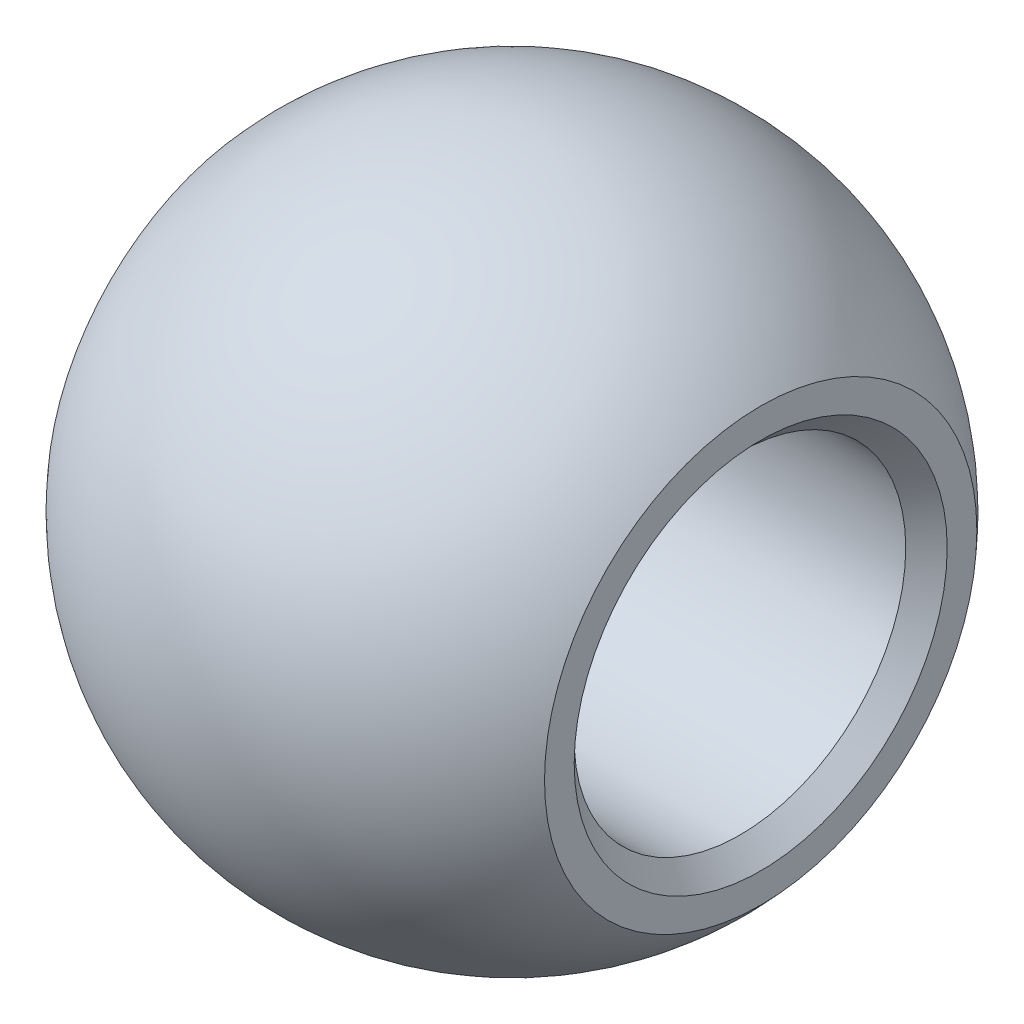
ISO-10303-21;
HEADER;
FILE_DESCRIPTION(('STEP AP214'),'2;1');
FILE_NAME('part.step','',(''),(''),'','','');
FILE_SCHEMA(('AUTOMOTIVE_DESIGN { 1 0 10303 214 1 1 1 1 }'));
ENDSEC;
DATA;
#1=APPLICATION_CONTEXT('core data for automotive mechanical design processes');
#2=APPLICATION_PROTOCOL_DEFINITION('international standard','automotive_design',2000,#1);
#3=PRODUCT_CONTEXT('',#1,'mechanical');
#4=PRODUCT('Part','Part','',(#3));
#5=PRODUCT_RELATED_PRODUCT_CATEGORY('part','',(#4));
#6=PRODUCT_DEFINITION_FORMATION('','',#4);
#7=PRODUCT_DEFINITION_CONTEXT('part definition',#1,'design');
#8=PRODUCT_DEFINITION('design','',#6,#7);
#9=PRODUCT_DEFINITION_SHAPE('','',#8);
#10=(LENGTH_UNIT() NAMED_UNIT(*) SI_UNIT(.MILLI.,.METRE.));
#11=(NAMED_UNIT(*) PLANE_ANGLE_UNIT() SI_UNIT($,.RADIAN.));
#12=(NAMED_UNIT(*) SI_UNIT($,.STERADIAN.) SOLID_ANGLE_UNIT());
#13=UNCERTAINTY_MEASURE_WITH_UNIT(LENGTH_MEASURE(1.E-05),#10,'distance_accuracy_value','');
#14=(GEOMETRIC_REPRESENTATION_CONTEXT(3) GLOBAL_UNCERTAINTY_ASSIGNED_CONTEXT((#13)) GLOBAL_UNIT_ASSIGNED_CONTEXT((#10,
#11,#12)) REPRESENTATION_CONTEXT('',''));
#15=CARTESIAN_POINT('',(0.,0.,0.));
#16=DIRECTION('',(0.,0.,1.));
#17=DIRECTION('',(1.,0.,0.));
#18=AXIS2_PLACEMENT_3D('',#15,#16,#17);
#19=CARTESIAN_POINT('',(0.,0.,0.));
#20=DIRECTION('',(1.,0.,0.));
#21=DIRECTION('',(0.,1.,0.));
#22=AXIS2_PLACEMENT_3D('',#19,#20,#21);
#23=SPHERICAL_SURFACE('',#22,7.95);
#24=CARTESIAN_POINT('',(-6.,0.,0.));
#25=DIRECTION('',(1.,0.,0.));
#26=DIRECTION('',(0.,0.,-1.));
#27=AXIS2_PLACEMENT_3D('',#24,#25,#26);
#28=CIRCLE('',#27,5.21560159521412);
#29=CARTESIAN_POINT('',(-6.,0.,-5.21560159521412));
#30=VERTEX_POINT('',#29);
#31=EDGE_CURVE('E50',#30,#30,#28,.T.);
#32=ORIENTED_EDGE('',*,*,#31,.T.);
#33=EDGE_LOOP('',(#32));
#34=FACE_BOUND('',#33,.T.);
#35=CARTESIAN_POINT('',(6.,0.,0.));
#36=DIRECTION('',(1.,0.,0.));
#37=DIRECTION('',(0.,0.,-1.));
#38=AXIS2_PLACEMENT_3D('',#35,#36,#37);
#39=CIRCLE('',#38,5.21560159521412);
#40=CARTESIAN_POINT('',(6.,0.,-5.21560159521412));
#41=VERTEX_POINT('',#40);
#42=EDGE_CURVE('E53',#41,#41,#39,.T.);
#43=ORIENTED_EDGE('',*,*,#42,.F.);
#44=EDGE_LOOP('',(#43));
#45=FACE_BOUND('',#44,.T.);
#46=ADVANCED_FACE('F30',(#34,#45),#23,.T.);
#47=CARTESIAN_POINT('',(-6.,4.,0.));
#48=DIRECTION('',(-1.,0.,0.));
#49=DIRECTION('',(0.,0.,1.));
#50=AXIS2_PLACEMENT_3D('',#47,#48,#49);
#51=PLANE('',#50);
#52=CARTESIAN_POINT('',(-6.,0.,0.));
#53=DIRECTION('',(-1.,0.,0.));
#54=DIRECTION('',(0.,0.,1.));
#55=AXIS2_PLACEMENT_3D('',#52,#53,#54);
#56=CIRCLE('',#55,4.5);
#57=CARTESIAN_POINT('',(-6.,0.,4.5));
#58=VERTEX_POINT('',#57);
#59=EDGE_CURVE('E45',#58,#58,#56,.F.);
#60=ORIENTED_EDGE('',*,*,#59,.T.);
#61=EDGE_LOOP('',(#60));
#62=FACE_BOUND('',#61,.T.);
#63=ORIENTED_EDGE('',*,*,#31,.F.);
#64=EDGE_LOOP('',(#63));
#65=FACE_BOUND('',#64,.T.);
#66=ADVANCED_FACE('F60',(#62,#65),#51,.T.);
#67=CARTESIAN_POINT('',(7.95,0.,0.));
#68=DIRECTION('',(1.,0.,0.));
#69=DIRECTION('',(0.,0.,-1.));
#70=AXIS2_PLACEMENT_3D('',#67,#68,#69);
#71=CYLINDRICAL_SURFACE('',#70,4.);
#72=CARTESIAN_POINT('',(-5.5,0.,0.));
#73=DIRECTION('',(-1.,0.,0.));
#74=DIRECTION('',(0.,0.,1.));
#75=AXIS2_PLACEMENT_3D('',#72,#73,#74);
#76=CIRCLE('',#75,4.);
#77=CARTESIAN_POINT('',(-5.5,0.,4.));
#78=VERTEX_POINT('',#77);
#79=EDGE_CURVE('E37',#78,#78,#76,.T.);
#80=ORIENTED_EDGE('',*,*,#79,.T.);
#81=EDGE_LOOP('',(#80));
#82=FACE_BOUND('',#81,.T.);
#83=CARTESIAN_POINT('',(5.5,0.,0.));
#84=DIRECTION('',(1.,0.,0.));
#85=DIRECTION('',(0.,0.,-1.));
#86=AXIS2_PLACEMENT_3D('',#83,#84,#85);
#87=CIRCLE('',#86,4.);
#88=CARTESIAN_POINT('',(5.5,0.,-4.));
#89=VERTEX_POINT('',#88);
#90=EDGE_CURVE('E41',#89,#89,#87,.T.);
#91=ORIENTED_EDGE('',*,*,#90,.T.);
#92=EDGE_LOOP('',(#91));
#93=FACE_BOUND('',#92,.T.);
#94=ADVANCED_FACE('F66',(#82,#93),#71,.F.);
#95=CARTESIAN_POINT('',(6.,5.21560159521411,0.));
#96=DIRECTION('',(1.,0.,0.));
#97=DIRECTION('',(0.,0.,-1.));
#98=AXIS2_PLACEMENT_3D('',#95,#96,#97);
#99=PLANE('',#98);
#100=CARTESIAN_POINT('',(6.,0.,0.));
#101=DIRECTION('',(1.,0.,0.));
#102=DIRECTION('',(0.,0.,-1.));
#103=AXIS2_PLACEMENT_3D('',#100,#101,#102);
#104=CIRCLE('',#103,4.50000000000001);
#105=CARTESIAN_POINT('',(6.,0.,-4.50000000000001));
#106=VERTEX_POINT('',#105);
#107=EDGE_CURVE('E10',#106,#106,#104,.F.);
#108=ORIENTED_EDGE('',*,*,#107,.T.);
#109=EDGE_LOOP('',(#108));
#110=FACE_BOUND('',#109,.T.);
#111=ORIENTED_EDGE('',*,*,#42,.T.);
#112=EDGE_LOOP('',(#111));
#113=FACE_BOUND('',#112,.T.);
#114=ADVANCED_FACE('F57',(#110,#113),#99,.T.);
#115=CARTESIAN_POINT('',(-6.,0.,0.));
#116=DIRECTION('',(-1.,0.,0.));
#117=DIRECTION('',(0.,0.,1.));
#118=AXIS2_PLACEMENT_3D('',#115,#116,#117);
#119=CONICAL_SURFACE('',#118,4.5,0.785398163397447);
#120=ORIENTED_EDGE('',*,*,#79,.F.);
#121=EDGE_LOOP('',(#120));
#122=FACE_BOUND('',#121,.T.);
#123=ORIENTED_EDGE('',*,*,#59,.F.);
#124=EDGE_LOOP('',(#123));
#125=FACE_BOUND('',#124,.T.);
#126=ADVANCED_FACE('F70',(#122,#125),#119,.F.);
#127=CARTESIAN_POINT('',(5.5,0.,0.));
#128=DIRECTION('',(1.,0.,0.));
#129=DIRECTION('',(0.,0.,-1.));
#130=AXIS2_PLACEMENT_3D('',#127,#128,#129);
#131=CONICAL_SURFACE('',#130,4.,0.785398163397453);
#132=ORIENTED_EDGE('',*,*,#107,.F.);
#133=EDGE_LOOP('',(#132));
#134=FACE_BOUND('',#133,.T.);
#135=ORIENTED_EDGE('',*,*,#90,.F.);
#136=EDGE_LOOP('',(#135));
#137=FACE_BOUND('',#136,.T.);
#138=ADVANCED_FACE('F32',(#134,#137),#131,.F.);
#139=CLOSED_SHELL('',(#46,#66,#94,#114,#126,#138));
#140=MANIFOLD_SOLID_BREP('B2',#139);
#141=ADVANCED_BREP_SHAPE_REPRESENTATION('',(#18,#140),#14);
#142=SHAPE_DEFINITION_REPRESENTATION(#9,#141);
ENDSEC;
END-ISO-10303-21;
